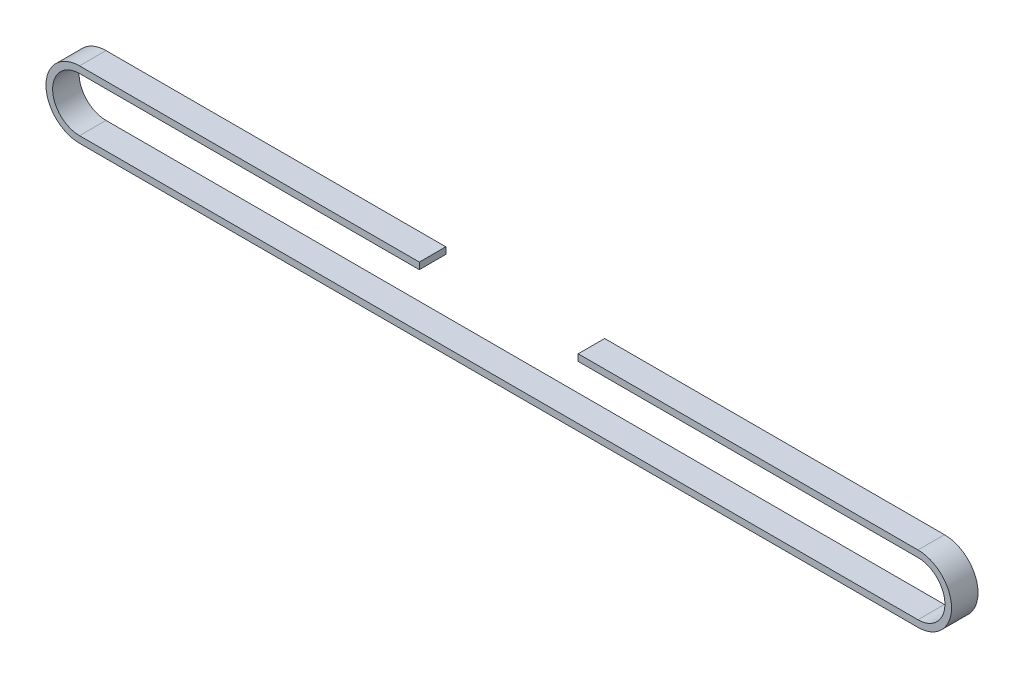
ISO-10303-21;
HEADER;
FILE_DESCRIPTION(('STEP AP214'),'2;1');
FILE_NAME('part.step','',(''),(''),'','','');
FILE_SCHEMA(('AUTOMOTIVE_DESIGN { 1 0 10303 214 1 1 1 1 }'));
ENDSEC;
DATA;
#1=APPLICATION_CONTEXT('core data for automotive mechanical design processes');
#2=APPLICATION_PROTOCOL_DEFINITION('international standard','automotive_design',2000,#1);
#3=PRODUCT_CONTEXT('',#1,'mechanical');
#4=PRODUCT('Part','Part','',(#3));
#5=PRODUCT_RELATED_PRODUCT_CATEGORY('part','',(#4));
#6=PRODUCT_DEFINITION_FORMATION('','',#4);
#7=PRODUCT_DEFINITION_CONTEXT('part definition',#1,'design');
#8=PRODUCT_DEFINITION('design','',#6,#7);
#9=PRODUCT_DEFINITION_SHAPE('','',#8);
#10=(LENGTH_UNIT() NAMED_UNIT(*) SI_UNIT(.MILLI.,.METRE.));
#11=(NAMED_UNIT(*) PLANE_ANGLE_UNIT() SI_UNIT($,.RADIAN.));
#12=(NAMED_UNIT(*) SI_UNIT($,.STERADIAN.) SOLID_ANGLE_UNIT());
#13=UNCERTAINTY_MEASURE_WITH_UNIT(LENGTH_MEASURE(1.E-05),#10,'distance_accuracy_value','');
#14=(GEOMETRIC_REPRESENTATION_CONTEXT(3) GLOBAL_UNCERTAINTY_ASSIGNED_CONTEXT((#13)) GLOBAL_UNIT_ASSIGNED_CONTEXT((#10,
#11,#12)) REPRESENTATION_CONTEXT('',''));
#15=CARTESIAN_POINT('',(0.,0.,0.));
#16=DIRECTION('',(0.,0.,1.));
#17=DIRECTION('',(1.,0.,0.));
#18=AXIS2_PLACEMENT_3D('',#15,#16,#17);
#19=CARTESIAN_POINT('',(-95.,7.60000000000003,3.));
#20=DIRECTION('',(0.,-1.,0.));
#21=DIRECTION('',(0.,0.,-1.));
#22=AXIS2_PLACEMENT_3D('',#19,#20,#21);
#23=PLANE('',#22);
#24=DIRECTION('',(-1.,0.,0.));
#25=VECTOR('',#24,1.);
#26=CARTESIAN_POINT('',(-95.,7.60000000000003,3.));
#27=LINE('',#26,#25);
#28=CARTESIAN_POINT('',(-18.,7.60000000000003,3.));
#29=VERTEX_POINT('',#28);
#30=CARTESIAN_POINT('',(-95.,7.60000000000003,3.));
#31=VERTEX_POINT('',#30);
#32=EDGE_CURVE('E172',#29,#31,#27,.T.);
#33=ORIENTED_EDGE('',*,*,#32,.F.);
#34=DIRECTION('',(0.,0.,1.));
#35=VECTOR('',#34,1.);
#36=CARTESIAN_POINT('',(-18.,7.60000000000003,-3.));
#37=LINE('',#36,#35);
#38=CARTESIAN_POINT('',(-18.,7.60000000000003,-3.));
#39=VERTEX_POINT('',#38);
#40=EDGE_CURVE('E215',#39,#29,#37,.T.);
#41=ORIENTED_EDGE('',*,*,#40,.F.);
#42=DIRECTION('',(-1.,0.,0.));
#43=VECTOR('',#42,1.);
#44=CARTESIAN_POINT('',(-95.,7.60000000000003,-3.));
#45=LINE('',#44,#43);
#46=CARTESIAN_POINT('',(-95.,7.60000000000003,-3.));
#47=VERTEX_POINT('',#46);
#48=EDGE_CURVE('E137',#39,#47,#45,.T.);
#49=ORIENTED_EDGE('',*,*,#48,.T.);
#50=DIRECTION('',(0.,0.,-1.));
#51=VECTOR('',#50,1.);
#52=CARTESIAN_POINT('',(-95.,7.60000000000003,3.));
#53=LINE('',#52,#51);
#54=EDGE_CURVE('E176',#31,#47,#53,.T.);
#55=ORIENTED_EDGE('',*,*,#54,.F.);
#56=EDGE_LOOP('',(#33,#41,#49,#55));
#57=FACE_BOUND('',#56,.T.);
#58=ADVANCED_FACE('F34',(#57),#23,.F.);
#59=CARTESIAN_POINT('',(-95.,6.10000000000003,3.));
#60=DIRECTION('',(0.,-1.,0.));
#61=DIRECTION('',(1.,0.,0.));
#62=AXIS2_PLACEMENT_3D('',#59,#60,#61);
#63=PLANE('',#62);
#64=DIRECTION('',(0.,0.,1.));
#65=VECTOR('',#64,1.);
#66=CARTESIAN_POINT('',(-18.,6.10000000000007,-3.));
#67=LINE('',#66,#65);
#68=CARTESIAN_POINT('',(-18.,6.10000000000007,-3.));
#69=VERTEX_POINT('',#68);
#70=CARTESIAN_POINT('',(-18.,6.10000000000005,3.));
#71=VERTEX_POINT('',#70);
#72=EDGE_CURVE('E120',#69,#71,#67,.T.);
#73=ORIENTED_EDGE('',*,*,#72,.T.);
#74=DIRECTION('',(-1.,0.,0.));
#75=VECTOR('',#74,1.);
#76=CARTESIAN_POINT('',(-95.,6.10000000000003,3.));
#77=LINE('',#76,#75);
#78=CARTESIAN_POINT('',(-95.,6.10000000000003,3.));
#79=VERTEX_POINT('',#78);
#80=EDGE_CURVE('E230',#71,#79,#77,.T.);
#81=ORIENTED_EDGE('',*,*,#80,.T.);
#82=DIRECTION('',(0.,0.,-1.));
#83=VECTOR('',#82,1.);
#84=CARTESIAN_POINT('',(-95.,6.10000000000003,3.));
#85=LINE('',#84,#83);
#86=CARTESIAN_POINT('',(-95.,6.10000000000003,-3.));
#87=VERTEX_POINT('',#86);
#88=EDGE_CURVE('E143',#79,#87,#85,.T.);
#89=ORIENTED_EDGE('',*,*,#88,.T.);
#90=DIRECTION('',(-1.,0.,0.));
#91=VECTOR('',#90,1.);
#92=CARTESIAN_POINT('',(-95.,6.10000000000003,-3.));
#93=LINE('',#92,#91);
#94=EDGE_CURVE('E134',#69,#87,#93,.T.);
#95=ORIENTED_EDGE('',*,*,#94,.F.);
#96=EDGE_LOOP('',(#73,#81,#89,#95));
#97=FACE_BOUND('',#96,.T.);
#98=ADVANCED_FACE('F141',(#97),#63,.T.);
#99=CARTESIAN_POINT('',(-95.,0.,3.));
#100=DIRECTION('',(0.,0.,1.));
#101=DIRECTION('',(1.,0.,0.));
#102=AXIS2_PLACEMENT_3D('',#99,#100,#101);
#103=PLANE('',#102);
#104=DIRECTION('',(0.,-1.,0.));
#105=VECTOR('',#104,1.);
#106=CARTESIAN_POINT('',(-18.,7.60000000000003,3.));
#107=LINE('',#106,#105);
#108=EDGE_CURVE('E49',#29,#71,#107,.T.);
#109=ORIENTED_EDGE('',*,*,#108,.F.);
#110=ORIENTED_EDGE('',*,*,#32,.T.);
#111=CARTESIAN_POINT('',(-95.,0.,3.));
#112=DIRECTION('',(0.,0.,1.));
#113=DIRECTION('',(1.,0.,0.));
#114=AXIS2_PLACEMENT_3D('',#111,#112,#113);
#115=CIRCLE('',#114,7.60000000000003);
#116=CARTESIAN_POINT('',(-95.,-7.60000000000003,3.));
#117=VERTEX_POINT('',#116);
#118=EDGE_CURVE('E164',#31,#117,#115,.T.);
#119=ORIENTED_EDGE('',*,*,#118,.T.);
#120=DIRECTION('',(1.,0.,0.));
#121=VECTOR('',#120,1.);
#122=CARTESIAN_POINT('',(-95.,-7.60000000000003,3.));
#123=LINE('',#122,#121);
#124=CARTESIAN_POINT('',(95.,-7.59999999999996,3.));
#125=VERTEX_POINT('',#124);
#126=EDGE_CURVE('E167',#117,#125,#123,.T.);
#127=ORIENTED_EDGE('',*,*,#126,.T.);
#128=CARTESIAN_POINT('',(95.,0.,3.));
#129=DIRECTION('',(0.,0.,1.));
#130=DIRECTION('',(1.,0.,0.));
#131=AXIS2_PLACEMENT_3D('',#128,#129,#130);
#132=CIRCLE('',#131,7.6);
#133=CARTESIAN_POINT('',(95.,7.60000000000003,3.));
#134=VERTEX_POINT('',#133);
#135=EDGE_CURVE('E170',#125,#134,#132,.T.);
#136=ORIENTED_EDGE('',*,*,#135,.T.);
#137=CARTESIAN_POINT('',(18.,7.60000000000003,3.));
#138=VERTEX_POINT('',#137);
#139=EDGE_CURVE('E173',#134,#138,#27,.T.);
#140=ORIENTED_EDGE('',*,*,#139,.T.);
#141=DIRECTION('',(0.,1.,0.));
#142=VECTOR('',#141,1.);
#143=CARTESIAN_POINT('',(18.,7.60000000000003,3.));
#144=LINE('',#143,#142);
#145=CARTESIAN_POINT('',(18.,6.10000000000007,3.));
#146=VERTEX_POINT('',#145);
#147=EDGE_CURVE('E138',#146,#138,#144,.T.);
#148=ORIENTED_EDGE('',*,*,#147,.F.);
#149=CARTESIAN_POINT('',(95.,6.10000000000007,3.));
#150=VERTEX_POINT('',#149);
#151=EDGE_CURVE('E156',#150,#146,#77,.T.);
#152=ORIENTED_EDGE('',*,*,#151,.F.);
#153=CARTESIAN_POINT('',(95.,0.,3.));
#154=DIRECTION('',(0.,0.,1.));
#155=DIRECTION('',(1.,0.,0.));
#156=AXIS2_PLACEMENT_3D('',#153,#154,#155);
#157=CIRCLE('',#156,6.10000000000003);
#158=CARTESIAN_POINT('',(95.,-6.1,3.));
#159=VERTEX_POINT('',#158);
#160=EDGE_CURVE('E227',#159,#150,#157,.T.);
#161=ORIENTED_EDGE('',*,*,#160,.F.);
#162=DIRECTION('',(1.,0.,0.));
#163=VECTOR('',#162,1.);
#164=CARTESIAN_POINT('',(-95.,-6.10000000000003,3.));
#165=LINE('',#164,#163);
#166=CARTESIAN_POINT('',(-95.,-6.10000000000003,3.));
#167=VERTEX_POINT('',#166);
#168=EDGE_CURVE('E225',#167,#159,#165,.T.);
#169=ORIENTED_EDGE('',*,*,#168,.F.);
#170=CARTESIAN_POINT('',(-95.,0.,3.));
#171=DIRECTION('',(0.,0.,1.));
#172=DIRECTION('',(1.,0.,0.));
#173=AXIS2_PLACEMENT_3D('',#170,#171,#172);
#174=CIRCLE('',#173,6.10000000000003);
#175=EDGE_CURVE('E148',#79,#167,#174,.T.);
#176=ORIENTED_EDGE('',*,*,#175,.F.);
#177=ORIENTED_EDGE('',*,*,#80,.F.);
#178=EDGE_LOOP('',(#109,#110,#119,#127,#136,#140,#148,#152,#161,#169,#176,#177));
#179=FACE_BOUND('',#178,.T.);
#180=ADVANCED_FACE('F205',(#179),#103,.T.);
#181=CARTESIAN_POINT('',(-95.,0.,-3.));
#182=DIRECTION('',(0.,0.,1.));
#183=DIRECTION('',(1.,0.,0.));
#184=AXIS2_PLACEMENT_3D('',#181,#182,#183);
#185=PLANE('',#184);
#186=ORIENTED_EDGE('',*,*,#48,.F.);
#187=DIRECTION('',(0.,-1.,0.));
#188=VECTOR('',#187,1.);
#189=CARTESIAN_POINT('',(-18.,7.60000000000003,-3.));
#190=LINE('',#189,#188);
#191=EDGE_CURVE('E123',#39,#69,#190,.T.);
#192=ORIENTED_EDGE('',*,*,#191,.T.);
#193=ORIENTED_EDGE('',*,*,#94,.T.);
#194=CARTESIAN_POINT('',(-95.,0.,-3.));
#195=DIRECTION('',(0.,0.,1.));
#196=DIRECTION('',(1.,0.,0.));
#197=AXIS2_PLACEMENT_3D('',#194,#195,#196);
#198=CIRCLE('',#197,6.10000000000003);
#199=CARTESIAN_POINT('',(-95.,-6.10000000000003,-3.));
#200=VERTEX_POINT('',#199);
#201=EDGE_CURVE('E216',#87,#200,#198,.T.);
#202=ORIENTED_EDGE('',*,*,#201,.T.);
#203=DIRECTION('',(1.,0.,0.));
#204=VECTOR('',#203,1.);
#205=CARTESIAN_POINT('',(-95.,-6.10000000000003,-3.));
#206=LINE('',#205,#204);
#207=CARTESIAN_POINT('',(95.,-6.1,-3.));
#208=VERTEX_POINT('',#207);
#209=EDGE_CURVE('E150',#200,#208,#206,.T.);
#210=ORIENTED_EDGE('',*,*,#209,.T.);
#211=CARTESIAN_POINT('',(95.,0.,-3.));
#212=DIRECTION('',(0.,0.,1.));
#213=DIRECTION('',(1.,0.,0.));
#214=AXIS2_PLACEMENT_3D('',#211,#212,#213);
#215=CIRCLE('',#214,6.10000000000003);
#216=CARTESIAN_POINT('',(95.,6.10000000000007,-3.));
#217=VERTEX_POINT('',#216);
#218=EDGE_CURVE('E145',#208,#217,#215,.T.);
#219=ORIENTED_EDGE('',*,*,#218,.T.);
#220=CARTESIAN_POINT('',(18.,6.10000000000005,-3.));
#221=VERTEX_POINT('',#220);
#222=EDGE_CURVE('E144',#217,#221,#93,.T.);
#223=ORIENTED_EDGE('',*,*,#222,.T.);
#224=DIRECTION('',(0.,1.,0.));
#225=VECTOR('',#224,1.);
#226=CARTESIAN_POINT('',(18.,7.60000000000003,-3.));
#227=LINE('',#226,#225);
#228=CARTESIAN_POINT('',(18.,7.60000000000003,-3.));
#229=VERTEX_POINT('',#228);
#230=EDGE_CURVE('E57',#221,#229,#227,.T.);
#231=ORIENTED_EDGE('',*,*,#230,.T.);
#232=CARTESIAN_POINT('',(95.,7.60000000000003,-3.));
#233=VERTEX_POINT('',#232);
#234=EDGE_CURVE('E168',#233,#229,#45,.T.);
#235=ORIENTED_EDGE('',*,*,#234,.F.);
#236=CARTESIAN_POINT('',(95.,0.,-3.));
#237=DIRECTION('',(0.,0.,1.));
#238=DIRECTION('',(1.,0.,0.));
#239=AXIS2_PLACEMENT_3D('',#236,#237,#238);
#240=CIRCLE('',#239,7.6);
#241=CARTESIAN_POINT('',(95.,-7.59999999999996,-3.));
#242=VERTEX_POINT('',#241);
#243=EDGE_CURVE('E181',#242,#233,#240,.T.);
#244=ORIENTED_EDGE('',*,*,#243,.F.);
#245=DIRECTION('',(1.,0.,0.));
#246=VECTOR('',#245,1.);
#247=CARTESIAN_POINT('',(-95.,-7.60000000000003,-3.));
#248=LINE('',#247,#246);
#249=CARTESIAN_POINT('',(-95.,-7.60000000000003,-3.));
#250=VERTEX_POINT('',#249);
#251=EDGE_CURVE('E179',#250,#242,#248,.T.);
#252=ORIENTED_EDGE('',*,*,#251,.F.);
#253=CARTESIAN_POINT('',(-95.,0.,-3.));
#254=DIRECTION('',(0.,0.,1.));
#255=DIRECTION('',(1.,0.,0.));
#256=AXIS2_PLACEMENT_3D('',#253,#254,#255);
#257=CIRCLE('',#256,7.60000000000003);
#258=EDGE_CURVE('E163',#47,#250,#257,.T.);
#259=ORIENTED_EDGE('',*,*,#258,.F.);
#260=EDGE_LOOP('',(#186,#192,#193,#202,#210,#219,#223,#231,#235,#244,#252,#259));
#261=FACE_BOUND('',#260,.T.);
#262=ADVANCED_FACE('F132',(#261),#185,.F.);
#263=CARTESIAN_POINT('',(-95.,0.,3.));
#264=DIRECTION('',(0.,0.,-1.));
#265=DIRECTION('',(-1.,0.,0.));
#266=AXIS2_PLACEMENT_3D('',#263,#264,#265);
#267=CYLINDRICAL_SURFACE('',#266,7.60000000000003);
#268=ORIENTED_EDGE('',*,*,#258,.T.);
#269=DIRECTION('',(0.,0.,-1.));
#270=VECTOR('',#269,1.);
#271=CARTESIAN_POINT('',(-95.,-7.60000000000003,3.));
#272=LINE('',#271,#270);
#273=EDGE_CURVE('E11',#117,#250,#272,.T.);
#274=ORIENTED_EDGE('',*,*,#273,.F.);
#275=ORIENTED_EDGE('',*,*,#118,.F.);
#276=ORIENTED_EDGE('',*,*,#54,.T.);
#277=EDGE_LOOP('',(#268,#274,#275,#276));
#278=FACE_BOUND('',#277,.T.);
#279=ADVANCED_FACE('F36',(#278),#267,.T.);
#280=CARTESIAN_POINT('',(-95.,-7.60000000000003,3.));
#281=DIRECTION('',(0.,1.,0.));
#282=DIRECTION('',(-1.,0.,0.));
#283=AXIS2_PLACEMENT_3D('',#280,#281,#282);
#284=PLANE('',#283);
#285=ORIENTED_EDGE('',*,*,#251,.T.);
#286=DIRECTION('',(0.,0.,-1.));
#287=VECTOR('',#286,1.);
#288=CARTESIAN_POINT('',(95.,-7.59999999999996,3.));
#289=LINE('',#288,#287);
#290=EDGE_CURVE('E42',#125,#242,#289,.T.);
#291=ORIENTED_EDGE('',*,*,#290,.F.);
#292=ORIENTED_EDGE('',*,*,#126,.F.);
#293=ORIENTED_EDGE('',*,*,#273,.T.);
#294=EDGE_LOOP('',(#285,#291,#292,#293));
#295=FACE_BOUND('',#294,.T.);
#296=ADVANCED_FACE('F210',(#295),#284,.F.);
#297=CARTESIAN_POINT('',(95.,0.,3.));
#298=DIRECTION('',(0.,0.,-1.));
#299=DIRECTION('',(-1.,0.,0.));
#300=AXIS2_PLACEMENT_3D('',#297,#298,#299);
#301=CYLINDRICAL_SURFACE('',#300,7.6);
#302=ORIENTED_EDGE('',*,*,#243,.T.);
#303=DIRECTION('',(0.,0.,-1.));
#304=VECTOR('',#303,1.);
#305=CARTESIAN_POINT('',(95.,7.60000000000003,3.));
#306=LINE('',#305,#304);
#307=EDGE_CURVE('E187',#134,#233,#306,.T.);
#308=ORIENTED_EDGE('',*,*,#307,.F.);
#309=ORIENTED_EDGE('',*,*,#135,.F.);
#310=ORIENTED_EDGE('',*,*,#290,.T.);
#311=EDGE_LOOP('',(#302,#308,#309,#310));
#312=FACE_BOUND('',#311,.T.);
#313=ADVANCED_FACE('F194',(#312),#301,.T.);
#314=ORIENTED_EDGE('',*,*,#234,.T.);
#315=DIRECTION('',(0.,0.,1.));
#316=VECTOR('',#315,1.);
#317=CARTESIAN_POINT('',(18.,7.60000000000003,-3.));
#318=LINE('',#317,#316);
#319=EDGE_CURVE('E202',#229,#138,#318,.T.);
#320=ORIENTED_EDGE('',*,*,#319,.T.);
#321=ORIENTED_EDGE('',*,*,#139,.F.);
#322=ORIENTED_EDGE('',*,*,#307,.T.);
#323=EDGE_LOOP('',(#314,#320,#321,#322));
#324=FACE_BOUND('',#323,.T.);
#325=ADVANCED_FACE('F200',(#324),#23,.F.);
#326=CARTESIAN_POINT('',(-95.,0.,3.));
#327=DIRECTION('',(0.,0.,-1.));
#328=DIRECTION('',(-1.,0.,0.));
#329=AXIS2_PLACEMENT_3D('',#326,#327,#328);
#330=CYLINDRICAL_SURFACE('',#329,6.10000000000003);
#331=ORIENTED_EDGE('',*,*,#201,.F.);
#332=ORIENTED_EDGE('',*,*,#88,.F.);
#333=ORIENTED_EDGE('',*,*,#175,.T.);
#334=DIRECTION('',(0.,0.,-1.));
#335=VECTOR('',#334,1.);
#336=CARTESIAN_POINT('',(-95.,-6.10000000000003,3.));
#337=LINE('',#336,#335);
#338=EDGE_CURVE('E160',#167,#200,#337,.T.);
#339=ORIENTED_EDGE('',*,*,#338,.T.);
#340=EDGE_LOOP('',(#331,#332,#333,#339));
#341=FACE_BOUND('',#340,.T.);
#342=ADVANCED_FACE('F239',(#341),#330,.F.);
#343=CARTESIAN_POINT('',(-95.,-6.10000000000003,3.));
#344=DIRECTION('',(0.,1.,0.));
#345=DIRECTION('',(-1.,0.,0.));
#346=AXIS2_PLACEMENT_3D('',#343,#344,#345);
#347=PLANE('',#346);
#348=ORIENTED_EDGE('',*,*,#209,.F.);
#349=ORIENTED_EDGE('',*,*,#338,.F.);
#350=ORIENTED_EDGE('',*,*,#168,.T.);
#351=DIRECTION('',(0.,0.,-1.));
#352=VECTOR('',#351,1.);
#353=CARTESIAN_POINT('',(95.,-6.1,3.));
#354=LINE('',#353,#352);
#355=EDGE_CURVE('E158',#159,#208,#354,.T.);
#356=ORIENTED_EDGE('',*,*,#355,.T.);
#357=EDGE_LOOP('',(#348,#349,#350,#356));
#358=FACE_BOUND('',#357,.T.);
#359=ADVANCED_FACE('F235',(#358),#347,.T.);
#360=CARTESIAN_POINT('',(95.,0.,3.));
#361=DIRECTION('',(0.,0.,-1.));
#362=DIRECTION('',(-1.,0.,0.));
#363=AXIS2_PLACEMENT_3D('',#360,#361,#362);
#364=CYLINDRICAL_SURFACE('',#363,6.10000000000003);
#365=ORIENTED_EDGE('',*,*,#218,.F.);
#366=ORIENTED_EDGE('',*,*,#355,.F.);
#367=ORIENTED_EDGE('',*,*,#160,.T.);
#368=DIRECTION('',(0.,0.,-1.));
#369=VECTOR('',#368,1.);
#370=CARTESIAN_POINT('',(95.,6.10000000000007,3.));
#371=LINE('',#370,#369);
#372=EDGE_CURVE('E155',#150,#217,#371,.T.);
#373=ORIENTED_EDGE('',*,*,#372,.T.);
#374=EDGE_LOOP('',(#365,#366,#367,#373));
#375=FACE_BOUND('',#374,.T.);
#376=ADVANCED_FACE('F243',(#375),#364,.F.);
#377=DIRECTION('',(0.,0.,1.));
#378=VECTOR('',#377,1.);
#379=CARTESIAN_POINT('',(18.,6.10000000000007,-3.));
#380=LINE('',#379,#378);
#381=EDGE_CURVE('E128',#221,#146,#380,.T.);
#382=ORIENTED_EDGE('',*,*,#381,.F.);
#383=ORIENTED_EDGE('',*,*,#222,.F.);
#384=ORIENTED_EDGE('',*,*,#372,.F.);
#385=ORIENTED_EDGE('',*,*,#151,.T.);
#386=EDGE_LOOP('',(#382,#383,#384,#385));
#387=FACE_BOUND('',#386,.T.);
#388=ADVANCED_FACE('F246',(#387),#63,.T.);
#389=CARTESIAN_POINT('',(18.,7.60000000000003,-3.));
#390=DIRECTION('',(1.,0.,0.));
#391=DIRECTION('',(0.,0.,-1.));
#392=AXIS2_PLACEMENT_3D('',#389,#390,#391);
#393=PLANE('',#392);
#394=ORIENTED_EDGE('',*,*,#147,.T.);
#395=ORIENTED_EDGE('',*,*,#319,.F.);
#396=ORIENTED_EDGE('',*,*,#230,.F.);
#397=ORIENTED_EDGE('',*,*,#381,.T.);
#398=EDGE_LOOP('',(#394,#395,#396,#397));
#399=FACE_BOUND('',#398,.T.);
#400=ADVANCED_FACE('F247',(#399),#393,.F.);
#401=CARTESIAN_POINT('',(-18.,7.60000000000003,-3.));
#402=DIRECTION('',(-1.,0.,0.));
#403=DIRECTION('',(0.,0.,1.));
#404=AXIS2_PLACEMENT_3D('',#401,#402,#403);
#405=PLANE('',#404);
#406=ORIENTED_EDGE('',*,*,#108,.T.);
#407=ORIENTED_EDGE('',*,*,#72,.F.);
#408=ORIENTED_EDGE('',*,*,#191,.F.);
#409=ORIENTED_EDGE('',*,*,#40,.T.);
#410=EDGE_LOOP('',(#406,#407,#408,#409));
#411=FACE_BOUND('',#410,.T.);
#412=ADVANCED_FACE('F122',(#411),#405,.F.);
#413=CLOSED_SHELL('',(#58,#98,#180,#262,#279,#296,#313,#325,#342,#359,#376,#388,#400,#412));
#414=MANIFOLD_SOLID_BREP('B2',#413);
#415=ADVANCED_BREP_SHAPE_REPRESENTATION('',(#18,#414),#14);
#416=SHAPE_DEFINITION_REPRESENTATION(#9,#415);
ENDSEC;
END-ISO-10303-21;
